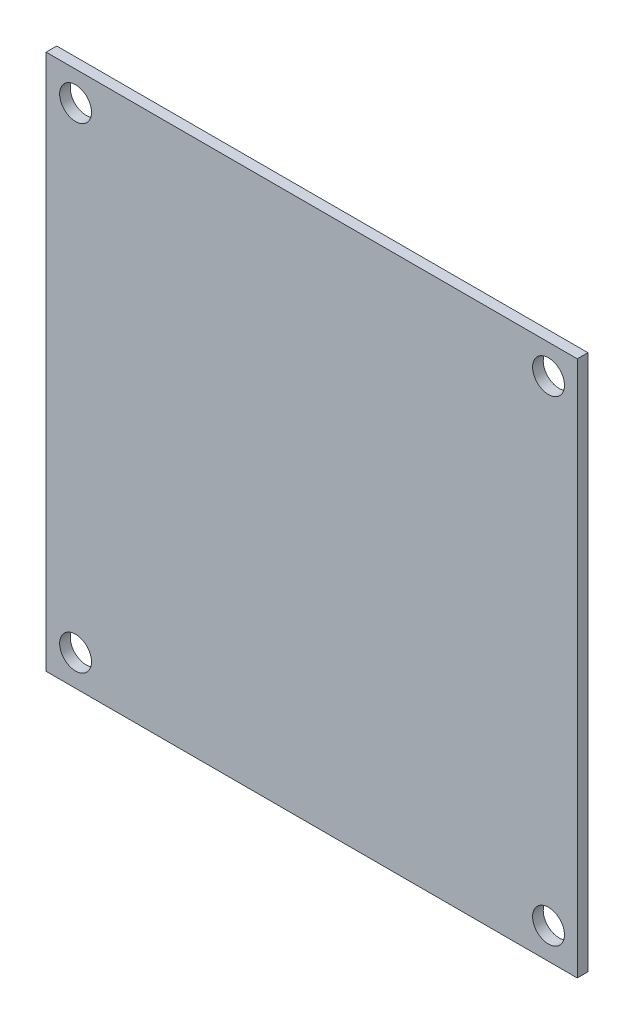
ISO-10303-21;
HEADER;
FILE_DESCRIPTION(('STEP AP214'),'2;1');
FILE_NAME('part.step','',(''),(''),'','','');
FILE_SCHEMA(('AUTOMOTIVE_DESIGN { 1 0 10303 214 1 1 1 1 }'));
ENDSEC;
DATA;
#1=APPLICATION_CONTEXT('core data for automotive mechanical design processes');
#2=APPLICATION_PROTOCOL_DEFINITION('international standard','automotive_design',2000,#1);
#3=PRODUCT_CONTEXT('',#1,'mechanical');
#4=PRODUCT('Part','Part','',(#3));
#5=PRODUCT_RELATED_PRODUCT_CATEGORY('part','',(#4));
#6=PRODUCT_DEFINITION_FORMATION('','',#4);
#7=PRODUCT_DEFINITION_CONTEXT('part definition',#1,'design');
#8=PRODUCT_DEFINITION('design','',#6,#7);
#9=PRODUCT_DEFINITION_SHAPE('','',#8);
#10=(LENGTH_UNIT() NAMED_UNIT(*) SI_UNIT(.MILLI.,.METRE.));
#11=(NAMED_UNIT(*) PLANE_ANGLE_UNIT() SI_UNIT($,.RADIAN.));
#12=(NAMED_UNIT(*) SI_UNIT($,.STERADIAN.) SOLID_ANGLE_UNIT());
#13=UNCERTAINTY_MEASURE_WITH_UNIT(LENGTH_MEASURE(1.E-05),#10,'distance_accuracy_value','');
#14=(GEOMETRIC_REPRESENTATION_CONTEXT(3) GLOBAL_UNCERTAINTY_ASSIGNED_CONTEXT((#13)) GLOBAL_UNIT_ASSIGNED_CONTEXT((#10,
#11,#12)) REPRESENTATION_CONTEXT('',''));
#15=CARTESIAN_POINT('',(0.,0.,0.));
#16=DIRECTION('',(0.,0.,1.));
#17=DIRECTION('',(1.,0.,0.));
#18=AXIS2_PLACEMENT_3D('',#15,#16,#17);
#19=CARTESIAN_POINT('',(-25.,40.,1.));
#20=DIRECTION('',(1.,0.,0.));
#21=DIRECTION('',(0.,1.,0.));
#22=AXIS2_PLACEMENT_3D('',#19,#20,#21);
#23=PLANE('',#22);
#24=DIRECTION('',(0.,-1.,0.));
#25=VECTOR('',#24,1.);
#26=CARTESIAN_POINT('',(-25.,40.,1.));
#27=LINE('',#26,#25);
#28=CARTESIAN_POINT('',(-25.,10.4808465454564,1.));
#29=VERTEX_POINT('',#28);
#30=CARTESIAN_POINT('',(-25.,-40.,1.));
#31=VERTEX_POINT('',#30);
#32=EDGE_CURVE('E84',#29,#31,#27,.T.);
#33=ORIENTED_EDGE('',*,*,#32,.F.);
#34=DIRECTION('',(0.,0.,-1.));
#35=VECTOR('',#34,1.);
#36=CARTESIAN_POINT('',(-25.,10.4808465454564,1.));
#37=LINE('',#36,#35);
#38=CARTESIAN_POINT('',(-25.,10.4808465454564,0.));
#39=VERTEX_POINT('',#38);
#40=EDGE_CURVE('E89',#29,#39,#37,.T.);
#41=ORIENTED_EDGE('',*,*,#40,.T.);
#42=DIRECTION('',(0.,-1.,0.));
#43=VECTOR('',#42,1.);
#44=CARTESIAN_POINT('',(-25.,40.,0.));
#45=LINE('',#44,#43);
#46=CARTESIAN_POINT('',(-25.,-40.,0.));
#47=VERTEX_POINT('',#46);
#48=EDGE_CURVE('E76',#39,#47,#45,.T.);
#49=ORIENTED_EDGE('',*,*,#48,.T.);
#50=DIRECTION('',(0.,0.,-1.));
#51=VECTOR('',#50,1.);
#52=CARTESIAN_POINT('',(-25.,-40.,1.));
#53=LINE('',#52,#51);
#54=EDGE_CURVE('E11',#31,#47,#53,.T.);
#55=ORIENTED_EDGE('',*,*,#54,.F.);
#56=EDGE_LOOP('',(#33,#41,#49,#55));
#57=FACE_BOUND('',#56,.T.);
#58=ADVANCED_FACE('F32',(#57),#23,.F.);
#59=CARTESIAN_POINT('',(25.,-40.,1.));
#60=DIRECTION('',(0.,1.,0.));
#61=DIRECTION('',(0.,0.,1.));
#62=AXIS2_PLACEMENT_3D('',#59,#60,#61);
#63=PLANE('',#62);
#64=DIRECTION('',(1.,0.,0.));
#65=VECTOR('',#64,1.);
#66=CARTESIAN_POINT('',(25.,-40.,0.));
#67=LINE('',#66,#65);
#68=CARTESIAN_POINT('',(25.,-40.,0.));
#69=VERTEX_POINT('',#68);
#70=EDGE_CURVE('E67',#47,#69,#67,.T.);
#71=ORIENTED_EDGE('',*,*,#70,.T.);
#72=DIRECTION('',(0.,0.,-1.));
#73=VECTOR('',#72,1.);
#74=CARTESIAN_POINT('',(25.,-40.,1.));
#75=LINE('',#74,#73);
#76=CARTESIAN_POINT('',(25.,-40.,1.));
#77=VERTEX_POINT('',#76);
#78=EDGE_CURVE('E39',#77,#69,#75,.T.);
#79=ORIENTED_EDGE('',*,*,#78,.F.);
#80=DIRECTION('',(1.,0.,0.));
#81=VECTOR('',#80,1.);
#82=CARTESIAN_POINT('',(25.,-40.,1.));
#83=LINE('',#82,#81);
#84=EDGE_CURVE('E55',#31,#77,#83,.T.);
#85=ORIENTED_EDGE('',*,*,#84,.F.);
#86=ORIENTED_EDGE('',*,*,#54,.T.);
#87=EDGE_LOOP('',(#71,#79,#85,#86));
#88=FACE_BOUND('',#87,.T.);
#89=ADVANCED_FACE('F69',(#88),#63,.F.);
#90=CARTESIAN_POINT('',(25.,40.,1.));
#91=DIRECTION('',(-1.,0.,0.));
#92=DIRECTION('',(0.,-1.,0.));
#93=AXIS2_PLACEMENT_3D('',#90,#91,#92);
#94=PLANE('',#93);
#95=DIRECTION('',(0.,1.,0.));
#96=VECTOR('',#95,1.);
#97=CARTESIAN_POINT('',(25.,40.,0.));
#98=LINE('',#97,#96);
#99=CARTESIAN_POINT('',(25.,10.4808465454564,0.));
#100=VERTEX_POINT('',#99);
#101=EDGE_CURVE('E75',#69,#100,#98,.T.);
#102=ORIENTED_EDGE('',*,*,#101,.T.);
#103=DIRECTION('',(0.,0.,-1.));
#104=VECTOR('',#103,1.);
#105=CARTESIAN_POINT('',(25.,10.4808465454564,1.));
#106=LINE('',#105,#104);
#107=CARTESIAN_POINT('',(25.,10.4808465454564,1.));
#108=VERTEX_POINT('',#107);
#109=EDGE_CURVE('E46',#108,#100,#106,.T.);
#110=ORIENTED_EDGE('',*,*,#109,.F.);
#111=DIRECTION('',(0.,1.,0.));
#112=VECTOR('',#111,1.);
#113=CARTESIAN_POINT('',(25.,40.,1.));
#114=LINE('',#113,#112);
#115=EDGE_CURVE('E81',#77,#108,#114,.T.);
#116=ORIENTED_EDGE('',*,*,#115,.F.);
#117=ORIENTED_EDGE('',*,*,#78,.T.);
#118=EDGE_LOOP('',(#102,#110,#116,#117));
#119=FACE_BOUND('',#118,.T.);
#120=ADVANCED_FACE('F80',(#119),#94,.F.);
#121=CARTESIAN_POINT('',(0.,0.,1.));
#122=DIRECTION('',(0.,0.,-1.));
#123=DIRECTION('',(-1.,0.,0.));
#124=AXIS2_PLACEMENT_3D('',#121,#122,#123);
#125=PLANE('',#124);
#126=CARTESIAN_POINT('',(22.2956076231508,-37.089644331293,1.));
#127=DIRECTION('',(0.,0.,-1.));
#128=DIRECTION('',(-1.,0.,0.));
#129=AXIS2_PLACEMENT_3D('',#126,#127,#128);
#130=CIRCLE('',#129,1.5);
#131=CARTESIAN_POINT('',(20.7956076231508,-37.089644331293,1.));
#132=VERTEX_POINT('',#131);
#133=EDGE_CURVE('E103',#132,#132,#130,.T.);
#134=ORIENTED_EDGE('',*,*,#133,.T.);
#135=EDGE_LOOP('',(#134));
#136=FACE_BOUND('',#135,.T.);
#137=CARTESIAN_POINT('',(-22.2266876614102,7.70833080023117,1.));
#138=DIRECTION('',(0.,0.,-1.));
#139=DIRECTION('',(-1.,0.,0.));
#140=AXIS2_PLACEMENT_3D('',#137,#138,#139);
#141=CIRCLE('',#140,1.5);
#142=CARTESIAN_POINT('',(-23.7266876614102,7.70833080023117,1.));
#143=VERTEX_POINT('',#142);
#144=EDGE_CURVE('E109',#143,#143,#141,.T.);
#145=ORIENTED_EDGE('',*,*,#144,.T.);
#146=EDGE_LOOP('',(#145));
#147=FACE_BOUND('',#146,.T.);
#148=CARTESIAN_POINT('',(-22.2266876614102,-37.089644331293,1.));
#149=DIRECTION('',(0.,0.,-1.));
#150=DIRECTION('',(-1.,0.,0.));
#151=AXIS2_PLACEMENT_3D('',#148,#149,#150);
#152=CIRCLE('',#151,1.5);
#153=CARTESIAN_POINT('',(-23.7266876614102,-37.089644331293,1.));
#154=VERTEX_POINT('',#153);
#155=EDGE_CURVE('E110',#154,#154,#152,.T.);
#156=ORIENTED_EDGE('',*,*,#155,.T.);
#157=EDGE_LOOP('',(#156));
#158=FACE_BOUND('',#157,.T.);
#159=CARTESIAN_POINT('',(22.2956076231508,7.70833080023117,1.));
#160=DIRECTION('',(0.,0.,-1.));
#161=DIRECTION('',(-1.,0.,0.));
#162=AXIS2_PLACEMENT_3D('',#159,#160,#161);
#163=CIRCLE('',#162,1.5);
#164=CARTESIAN_POINT('',(20.7956076231508,7.70833080023117,1.));
#165=VERTEX_POINT('',#164);
#166=EDGE_CURVE('E97',#165,#165,#163,.T.);
#167=ORIENTED_EDGE('',*,*,#166,.T.);
#168=EDGE_LOOP('',(#167));
#169=FACE_BOUND('',#168,.T.);
#170=ORIENTED_EDGE('',*,*,#115,.T.);
#171=DIRECTION('',(-1.,0.,0.));
#172=VECTOR('',#171,1.);
#173=CARTESIAN_POINT('',(-25.,10.4808465454564,1.));
#174=LINE('',#173,#172);
#175=EDGE_CURVE('E93',#108,#29,#174,.T.);
#176=ORIENTED_EDGE('',*,*,#175,.T.);
#177=ORIENTED_EDGE('',*,*,#32,.T.);
#178=ORIENTED_EDGE('',*,*,#84,.T.);
#179=EDGE_LOOP('',(#170,#176,#177,#178));
#180=FACE_BOUND('',#179,.T.);
#181=ADVANCED_FACE('F124',(#136,#147,#158,#169,#180),#125,.F.);
#182=CARTESIAN_POINT('',(0.,0.,0.));
#183=DIRECTION('',(0.,0.,-1.));
#184=DIRECTION('',(-1.,0.,0.));
#185=AXIS2_PLACEMENT_3D('',#182,#183,#184);
#186=PLANE('',#185);
#187=CARTESIAN_POINT('',(22.2956076231508,-37.089644331293,0.));
#188=DIRECTION('',(0.,0.,-1.));
#189=DIRECTION('',(-1.,0.,0.));
#190=AXIS2_PLACEMENT_3D('',#187,#188,#189);
#191=CIRCLE('',#190,1.5);
#192=CARTESIAN_POINT('',(20.7956076231508,-37.089644331293,0.));
#193=VERTEX_POINT('',#192);
#194=EDGE_CURVE('E113',#193,#193,#191,.T.);
#195=ORIENTED_EDGE('',*,*,#194,.F.);
#196=EDGE_LOOP('',(#195));
#197=FACE_BOUND('',#196,.T.);
#198=CARTESIAN_POINT('',(-22.2266876614102,7.70833080023117,0.));
#199=DIRECTION('',(0.,0.,-1.));
#200=DIRECTION('',(-1.,0.,0.));
#201=AXIS2_PLACEMENT_3D('',#198,#199,#200);
#202=CIRCLE('',#201,1.5);
#203=CARTESIAN_POINT('',(-23.7266876614102,7.70833080023117,0.));
#204=VERTEX_POINT('',#203);
#205=EDGE_CURVE('E106',#204,#204,#202,.T.);
#206=ORIENTED_EDGE('',*,*,#205,.F.);
#207=EDGE_LOOP('',(#206));
#208=FACE_BOUND('',#207,.T.);
#209=CARTESIAN_POINT('',(-22.2266876614102,-37.089644331293,0.));
#210=DIRECTION('',(0.,0.,-1.));
#211=DIRECTION('',(-1.,0.,0.));
#212=AXIS2_PLACEMENT_3D('',#209,#210,#211);
#213=CIRCLE('',#212,1.5);
#214=CARTESIAN_POINT('',(-23.7266876614102,-37.089644331293,0.));
#215=VERTEX_POINT('',#214);
#216=EDGE_CURVE('E118',#215,#215,#213,.T.);
#217=ORIENTED_EDGE('',*,*,#216,.F.);
#218=EDGE_LOOP('',(#217));
#219=FACE_BOUND('',#218,.T.);
#220=CARTESIAN_POINT('',(22.2956076231508,7.70833080023117,0.));
#221=DIRECTION('',(0.,0.,-1.));
#222=DIRECTION('',(-1.,0.,0.));
#223=AXIS2_PLACEMENT_3D('',#220,#221,#222);
#224=CIRCLE('',#223,1.5);
#225=CARTESIAN_POINT('',(20.7956076231508,7.70833080023117,0.));
#226=VERTEX_POINT('',#225);
#227=EDGE_CURVE('E100',#226,#226,#224,.T.);
#228=ORIENTED_EDGE('',*,*,#227,.F.);
#229=EDGE_LOOP('',(#228));
#230=FACE_BOUND('',#229,.T.);
#231=DIRECTION('',(-1.,0.,0.));
#232=VECTOR('',#231,1.);
#233=CARTESIAN_POINT('',(-25.,10.4808465454564,0.));
#234=LINE('',#233,#232);
#235=EDGE_CURVE('E83',#100,#39,#234,.T.);
#236=ORIENTED_EDGE('',*,*,#235,.F.);
#237=ORIENTED_EDGE('',*,*,#101,.F.);
#238=ORIENTED_EDGE('',*,*,#70,.F.);
#239=ORIENTED_EDGE('',*,*,#48,.F.);
#240=EDGE_LOOP('',(#236,#237,#238,#239));
#241=FACE_BOUND('',#240,.T.);
#242=ADVANCED_FACE('F82',(#197,#208,#219,#230,#241),#186,.T.);
#243=CARTESIAN_POINT('',(-25.,10.4808465454564,1.));
#244=DIRECTION('',(0.,-1.,0.));
#245=DIRECTION('',(0.,0.,-1.));
#246=AXIS2_PLACEMENT_3D('',#243,#244,#245);
#247=PLANE('',#246);
#248=ORIENTED_EDGE('',*,*,#235,.T.);
#249=ORIENTED_EDGE('',*,*,#40,.F.);
#250=ORIENTED_EDGE('',*,*,#175,.F.);
#251=ORIENTED_EDGE('',*,*,#109,.T.);
#252=EDGE_LOOP('',(#248,#249,#250,#251));
#253=FACE_BOUND('',#252,.T.);
#254=ADVANCED_FACE('F137',(#253),#247,.F.);
#255=CARTESIAN_POINT('',(22.2956076231508,7.70833080023117,1.));
#256=DIRECTION('',(0.,0.,-1.));
#257=DIRECTION('',(-1.,0.,0.));
#258=AXIS2_PLACEMENT_3D('',#255,#256,#257);
#259=CYLINDRICAL_SURFACE('',#258,1.5);
#260=ORIENTED_EDGE('',*,*,#166,.F.);
#261=EDGE_LOOP('',(#260));
#262=FACE_BOUND('',#261,.T.);
#263=ORIENTED_EDGE('',*,*,#227,.T.);
#264=EDGE_LOOP('',(#263));
#265=FACE_BOUND('',#264,.T.);
#266=ADVANCED_FACE('F131',(#262,#265),#259,.F.);
#267=CARTESIAN_POINT('',(-22.2266876614102,-37.089644331293,1.));
#268=DIRECTION('',(0.,0.,-1.));
#269=DIRECTION('',(-1.,0.,0.));
#270=AXIS2_PLACEMENT_3D('',#267,#268,#269);
#271=CYLINDRICAL_SURFACE('',#270,1.5);
#272=ORIENTED_EDGE('',*,*,#155,.F.);
#273=EDGE_LOOP('',(#272));
#274=FACE_BOUND('',#273,.T.);
#275=ORIENTED_EDGE('',*,*,#216,.T.);
#276=EDGE_LOOP('',(#275));
#277=FACE_BOUND('',#276,.T.);
#278=ADVANCED_FACE('F127',(#274,#277),#271,.F.);
#279=CARTESIAN_POINT('',(-22.2266876614102,7.70833080023117,1.));
#280=DIRECTION('',(0.,0.,-1.));
#281=DIRECTION('',(-1.,0.,0.));
#282=AXIS2_PLACEMENT_3D('',#279,#280,#281);
#283=CYLINDRICAL_SURFACE('',#282,1.5);
#284=ORIENTED_EDGE('',*,*,#144,.F.);
#285=EDGE_LOOP('',(#284));
#286=FACE_BOUND('',#285,.T.);
#287=ORIENTED_EDGE('',*,*,#205,.T.);
#288=EDGE_LOOP('',(#287));
#289=FACE_BOUND('',#288,.T.);
#290=ADVANCED_FACE('F130',(#286,#289),#283,.F.);
#291=CARTESIAN_POINT('',(22.2956076231508,-37.089644331293,1.));
#292=DIRECTION('',(0.,0.,-1.));
#293=DIRECTION('',(-1.,0.,0.));
#294=AXIS2_PLACEMENT_3D('',#291,#292,#293);
#295=CYLINDRICAL_SURFACE('',#294,1.5);
#296=ORIENTED_EDGE('',*,*,#133,.F.);
#297=EDGE_LOOP('',(#296));
#298=FACE_BOUND('',#297,.T.);
#299=ORIENTED_EDGE('',*,*,#194,.T.);
#300=EDGE_LOOP('',(#299));
#301=FACE_BOUND('',#300,.T.);
#302=ADVANCED_FACE('F175',(#298,#301),#295,.F.);
#303=CLOSED_SHELL('',(#58,#89,#120,#181,#242,#254,#266,#278,#290,#302));
#304=MANIFOLD_SOLID_BREP('B2',#303);
#305=ADVANCED_BREP_SHAPE_REPRESENTATION('',(#18,#304),#14);
#306=SHAPE_DEFINITION_REPRESENTATION(#9,#305);
ENDSEC;
END-ISO-10303-21;
